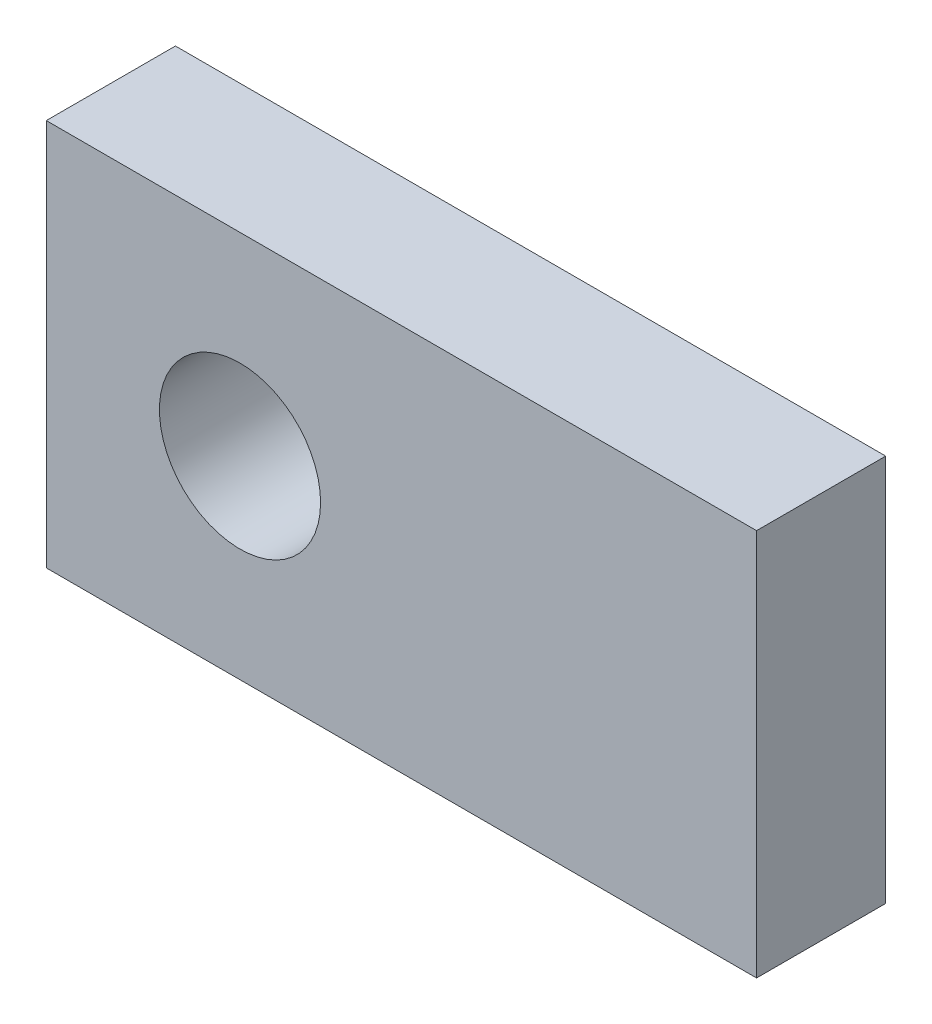
ISO-10303-21;
HEADER;
FILE_DESCRIPTION(('STEP AP214'),'2;1');
FILE_NAME('part.step','',(''),(''),'','','');
FILE_SCHEMA(('AUTOMOTIVE_DESIGN { 1 0 10303 214 1 1 1 1 }'));
ENDSEC;
DATA;
#1=APPLICATION_CONTEXT('core data for automotive mechanical design processes');
#2=APPLICATION_PROTOCOL_DEFINITION('international standard','automotive_design',2000,#1);
#3=PRODUCT_CONTEXT('',#1,'mechanical');
#4=PRODUCT('Part','Part','',(#3));
#5=PRODUCT_RELATED_PRODUCT_CATEGORY('part','',(#4));
#6=PRODUCT_DEFINITION_FORMATION('','',#4);
#7=PRODUCT_DEFINITION_CONTEXT('part definition',#1,'design');
#8=PRODUCT_DEFINITION('design','',#6,#7);
#9=PRODUCT_DEFINITION_SHAPE('','',#8);
#10=(LENGTH_UNIT() NAMED_UNIT(*) SI_UNIT(.MILLI.,.METRE.));
#11=(NAMED_UNIT(*) PLANE_ANGLE_UNIT() SI_UNIT($,.RADIAN.));
#12=(NAMED_UNIT(*) SI_UNIT($,.STERADIAN.) SOLID_ANGLE_UNIT());
#13=UNCERTAINTY_MEASURE_WITH_UNIT(LENGTH_MEASURE(1.E-05),#10,'distance_accuracy_value','');
#14=(GEOMETRIC_REPRESENTATION_CONTEXT(3) GLOBAL_UNCERTAINTY_ASSIGNED_CONTEXT((#13)) GLOBAL_UNIT_ASSIGNED_CONTEXT((#10,
#11,#12)) REPRESENTATION_CONTEXT('',''));
#15=CARTESIAN_POINT('',(0.,0.,0.));
#16=DIRECTION('',(0.,0.,1.));
#17=DIRECTION('',(1.,0.,0.));
#18=AXIS2_PLACEMENT_3D('',#15,#16,#17);
#19=CARTESIAN_POINT('',(0.,0.,6.35));
#20=DIRECTION('',(0.,0.,1.));
#21=DIRECTION('',(1.,0.,0.));
#22=AXIS2_PLACEMENT_3D('',#19,#20,#21);
#23=PLANE('',#22);
#24=DIRECTION('',(0.,-1.,0.));
#25=VECTOR('',#24,1.);
#26=CARTESIAN_POINT('',(-9.525,9.525,6.35));
#27=LINE('',#26,#25);
#28=CARTESIAN_POINT('',(-9.525,9.525,6.35));
#29=VERTEX_POINT('',#28);
#30=CARTESIAN_POINT('',(-9.525,-9.525,6.35));
#31=VERTEX_POINT('',#30);
#32=EDGE_CURVE('E98',#29,#31,#27,.T.);
#33=ORIENTED_EDGE('',*,*,#32,.T.);
#34=DIRECTION('',(1.,0.,0.));
#35=VECTOR('',#34,1.);
#36=CARTESIAN_POINT('',(-9.525,-9.525,6.35));
#37=LINE('',#36,#35);
#38=CARTESIAN_POINT('',(25.4,-9.525,6.35));
#39=VERTEX_POINT('',#38);
#40=EDGE_CURVE('E93',#31,#39,#37,.T.);
#41=ORIENTED_EDGE('',*,*,#40,.T.);
#42=DIRECTION('',(0.,1.,0.));
#43=VECTOR('',#42,1.);
#44=CARTESIAN_POINT('',(25.4,9.525,6.35));
#45=LINE('',#44,#43);
#46=CARTESIAN_POINT('',(25.4,9.525,6.35));
#47=VERTEX_POINT('',#46);
#48=EDGE_CURVE('E96',#39,#47,#45,.T.);
#49=ORIENTED_EDGE('',*,*,#48,.T.);
#50=DIRECTION('',(-1.,0.,0.));
#51=VECTOR('',#50,1.);
#52=CARTESIAN_POINT('',(-9.525,9.525,6.35));
#53=LINE('',#52,#51);
#54=EDGE_CURVE('E63',#47,#29,#53,.T.);
#55=ORIENTED_EDGE('',*,*,#54,.T.);
#56=EDGE_LOOP('',(#33,#41,#49,#55));
#57=FACE_BOUND('',#56,.T.);
#58=CARTESIAN_POINT('',(0.,0.,6.35));
#59=DIRECTION('',(0.,0.,1.));
#60=DIRECTION('',(1.,0.,0.));
#61=AXIS2_PLACEMENT_3D('',#58,#59,#60);
#62=CIRCLE('',#61,3.9624);
#63=CARTESIAN_POINT('',(3.9624,0.,6.35));
#64=VERTEX_POINT('',#63);
#65=EDGE_CURVE('E113',#64,#64,#62,.T.);
#66=ORIENTED_EDGE('',*,*,#65,.F.);
#67=EDGE_LOOP('',(#66));
#68=FACE_BOUND('',#67,.T.);
#69=ADVANCED_FACE('F46',(#57,#68),#23,.T.);
#70=CARTESIAN_POINT('',(0.,0.,0.));
#71=DIRECTION('',(0.,0.,1.));
#72=DIRECTION('',(1.,0.,0.));
#73=AXIS2_PLACEMENT_3D('',#70,#71,#72);
#74=PLANE('',#73);
#75=DIRECTION('',(0.,-1.,0.));
#76=VECTOR('',#75,1.);
#77=CARTESIAN_POINT('',(-9.525,9.525,0.));
#78=LINE('',#77,#76);
#79=CARTESIAN_POINT('',(-9.525,9.525,0.));
#80=VERTEX_POINT('',#79);
#81=CARTESIAN_POINT('',(-9.525,-9.525,0.));
#82=VERTEX_POINT('',#81);
#83=EDGE_CURVE('E110',#80,#82,#78,.T.);
#84=ORIENTED_EDGE('',*,*,#83,.F.);
#85=DIRECTION('',(-1.,0.,0.));
#86=VECTOR('',#85,1.);
#87=CARTESIAN_POINT('',(-9.525,9.525,0.));
#88=LINE('',#87,#86);
#89=CARTESIAN_POINT('',(25.4,9.525,0.));
#90=VERTEX_POINT('',#89);
#91=EDGE_CURVE('E86',#90,#80,#88,.T.);
#92=ORIENTED_EDGE('',*,*,#91,.F.);
#93=DIRECTION('',(0.,1.,0.));
#94=VECTOR('',#93,1.);
#95=CARTESIAN_POINT('',(25.4,9.525,0.));
#96=LINE('',#95,#94);
#97=CARTESIAN_POINT('',(25.4,-9.525,0.));
#98=VERTEX_POINT('',#97);
#99=EDGE_CURVE('E80',#98,#90,#96,.T.);
#100=ORIENTED_EDGE('',*,*,#99,.F.);
#101=DIRECTION('',(1.,0.,0.));
#102=VECTOR('',#101,1.);
#103=CARTESIAN_POINT('',(-9.525,-9.525,0.));
#104=LINE('',#103,#102);
#105=EDGE_CURVE('E102',#82,#98,#104,.T.);
#106=ORIENTED_EDGE('',*,*,#105,.F.);
#107=EDGE_LOOP('',(#84,#92,#100,#106));
#108=FACE_BOUND('',#107,.T.);
#109=CARTESIAN_POINT('',(0.,0.,0.));
#110=DIRECTION('',(0.,0.,1.));
#111=DIRECTION('',(1.,0.,0.));
#112=AXIS2_PLACEMENT_3D('',#109,#110,#111);
#113=CIRCLE('',#112,3.9624);
#114=CARTESIAN_POINT('',(3.9624,0.,0.));
#115=VERTEX_POINT('',#114);
#116=EDGE_CURVE('E125',#115,#115,#113,.T.);
#117=ORIENTED_EDGE('',*,*,#116,.T.);
#118=EDGE_LOOP('',(#117));
#119=FACE_BOUND('',#118,.T.);
#120=ADVANCED_FACE('F121',(#108,#119),#74,.F.);
#121=CARTESIAN_POINT('',(-9.525,9.525,6.35));
#122=DIRECTION('',(1.,0.,0.));
#123=DIRECTION('',(0.,1.,0.));
#124=AXIS2_PLACEMENT_3D('',#121,#122,#123);
#125=PLANE('',#124);
#126=ORIENTED_EDGE('',*,*,#83,.T.);
#127=DIRECTION('',(0.,0.,-1.));
#128=VECTOR('',#127,1.);
#129=CARTESIAN_POINT('',(-9.525,-9.525,6.35));
#130=LINE('',#129,#128);
#131=EDGE_CURVE('E13',#31,#82,#130,.T.);
#132=ORIENTED_EDGE('',*,*,#131,.F.);
#133=ORIENTED_EDGE('',*,*,#32,.F.);
#134=DIRECTION('',(0.,0.,-1.));
#135=VECTOR('',#134,1.);
#136=CARTESIAN_POINT('',(-9.525,9.525,6.35));
#137=LINE('',#136,#135);
#138=EDGE_CURVE('E106',#29,#80,#137,.T.);
#139=ORIENTED_EDGE('',*,*,#138,.T.);
#140=EDGE_LOOP('',(#126,#132,#133,#139));
#141=FACE_BOUND('',#140,.T.);
#142=ADVANCED_FACE('F48',(#141),#125,.F.);
#143=CARTESIAN_POINT('',(-9.525,-9.525,6.35));
#144=DIRECTION('',(0.,1.,0.));
#145=DIRECTION('',(0.,0.,1.));
#146=AXIS2_PLACEMENT_3D('',#143,#144,#145);
#147=PLANE('',#146);
#148=ORIENTED_EDGE('',*,*,#105,.T.);
#149=DIRECTION('',(0.,0.,-1.));
#150=VECTOR('',#149,1.);
#151=CARTESIAN_POINT('',(25.4,-9.525,6.35));
#152=LINE('',#151,#150);
#153=EDGE_CURVE('E55',#39,#98,#152,.T.);
#154=ORIENTED_EDGE('',*,*,#153,.F.);
#155=ORIENTED_EDGE('',*,*,#40,.F.);
#156=ORIENTED_EDGE('',*,*,#131,.T.);
#157=EDGE_LOOP('',(#148,#154,#155,#156));
#158=FACE_BOUND('',#157,.T.);
#159=ADVANCED_FACE('F101',(#158),#147,.F.);
#160=CARTESIAN_POINT('',(25.4,9.525,6.35));
#161=DIRECTION('',(-1.,0.,0.));
#162=DIRECTION('',(0.,-1.,0.));
#163=AXIS2_PLACEMENT_3D('',#160,#161,#162);
#164=PLANE('',#163);
#165=ORIENTED_EDGE('',*,*,#99,.T.);
#166=DIRECTION('',(0.,0.,-1.));
#167=VECTOR('',#166,1.);
#168=CARTESIAN_POINT('',(25.4,9.525,6.35));
#169=LINE('',#168,#167);
#170=EDGE_CURVE('E103',#47,#90,#169,.T.);
#171=ORIENTED_EDGE('',*,*,#170,.F.);
#172=ORIENTED_EDGE('',*,*,#48,.F.);
#173=ORIENTED_EDGE('',*,*,#153,.T.);
#174=EDGE_LOOP('',(#165,#171,#172,#173));
#175=FACE_BOUND('',#174,.T.);
#176=ADVANCED_FACE('F104',(#175),#164,.F.);
#177=CARTESIAN_POINT('',(-9.525,9.525,6.35));
#178=DIRECTION('',(0.,-1.,0.));
#179=DIRECTION('',(0.,0.,-1.));
#180=AXIS2_PLACEMENT_3D('',#177,#178,#179);
#181=PLANE('',#180);
#182=ORIENTED_EDGE('',*,*,#91,.T.);
#183=ORIENTED_EDGE('',*,*,#138,.F.);
#184=ORIENTED_EDGE('',*,*,#54,.F.);
#185=ORIENTED_EDGE('',*,*,#170,.T.);
#186=EDGE_LOOP('',(#182,#183,#184,#185));
#187=FACE_BOUND('',#186,.T.);
#188=ADVANCED_FACE('F118',(#187),#181,.F.);
#189=CARTESIAN_POINT('',(0.,0.,6.35));
#190=DIRECTION('',(0.,0.,-1.));
#191=DIRECTION('',(-1.,0.,0.));
#192=AXIS2_PLACEMENT_3D('',#189,#190,#191);
#193=CYLINDRICAL_SURFACE('',#192,3.9624);
#194=ORIENTED_EDGE('',*,*,#65,.T.);
#195=EDGE_LOOP('',(#194));
#196=FACE_BOUND('',#195,.T.);
#197=ORIENTED_EDGE('',*,*,#116,.F.);
#198=EDGE_LOOP('',(#197));
#199=FACE_BOUND('',#198,.T.);
#200=ADVANCED_FACE('F131',(#196,#199),#193,.F.);
#201=CLOSED_SHELL('',(#69,#120,#142,#159,#176,#188,#200));
#202=MANIFOLD_SOLID_BREP('B2',#201);
#203=ADVANCED_BREP_SHAPE_REPRESENTATION('',(#18,#202),#14);
#204=SHAPE_DEFINITION_REPRESENTATION(#9,#203);
ENDSEC;
END-ISO-10303-21;
